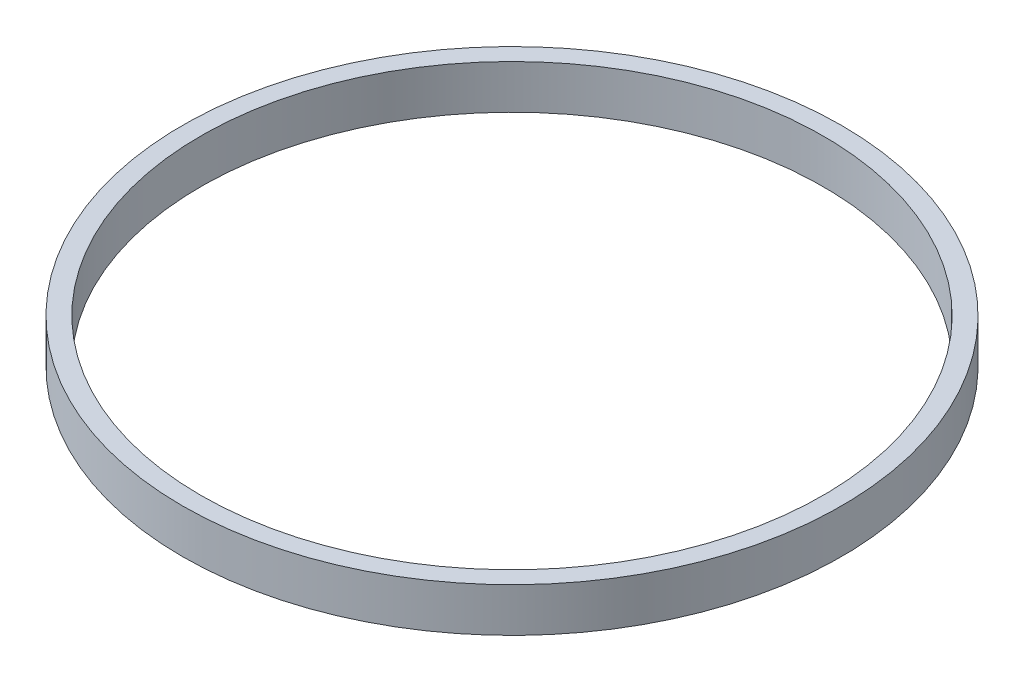
ISO-10303-21;
HEADER;
FILE_DESCRIPTION(('STEP AP214'),'2;1');
FILE_NAME('part.step','',(''),(''),'','','');
FILE_SCHEMA(('AUTOMOTIVE_DESIGN { 1 0 10303 214 1 1 1 1 }'));
ENDSEC;
DATA;
#1=APPLICATION_CONTEXT('core data for automotive mechanical design processes');
#2=APPLICATION_PROTOCOL_DEFINITION('international standard','automotive_design',2000,#1);
#3=PRODUCT_CONTEXT('',#1,'mechanical');
#4=PRODUCT('Part','Part','',(#3));
#5=PRODUCT_RELATED_PRODUCT_CATEGORY('part','',(#4));
#6=PRODUCT_DEFINITION_FORMATION('','',#4);
#7=PRODUCT_DEFINITION_CONTEXT('part definition',#1,'design');
#8=PRODUCT_DEFINITION('design','',#6,#7);
#9=PRODUCT_DEFINITION_SHAPE('','',#8);
#10=(LENGTH_UNIT() NAMED_UNIT(*) SI_UNIT(.MILLI.,.METRE.));
#11=(NAMED_UNIT(*) PLANE_ANGLE_UNIT() SI_UNIT($,.RADIAN.));
#12=(NAMED_UNIT(*) SI_UNIT($,.STERADIAN.) SOLID_ANGLE_UNIT());
#13=UNCERTAINTY_MEASURE_WITH_UNIT(LENGTH_MEASURE(1.E-05),#10,'distance_accuracy_value','');
#14=(GEOMETRIC_REPRESENTATION_CONTEXT(3) GLOBAL_UNCERTAINTY_ASSIGNED_CONTEXT((#13)) GLOBAL_UNIT_ASSIGNED_CONTEXT((#10,
#11,#12)) REPRESENTATION_CONTEXT('',''));
#15=CARTESIAN_POINT('',(0.,0.,0.));
#16=DIRECTION('',(0.,0.,1.));
#17=DIRECTION('',(1.,0.,0.));
#18=AXIS2_PLACEMENT_3D('',#15,#16,#17);
#19=CARTESIAN_POINT('',(0.,6.,0.));
#20=DIRECTION('',(0.,1.,0.));
#21=DIRECTION('',(0.,0.,1.));
#22=AXIS2_PLACEMENT_3D('',#19,#20,#21);
#23=PLANE('',#22);
#24=CARTESIAN_POINT('',(0.,6.,0.));
#25=DIRECTION('',(0.,1.,0.));
#26=DIRECTION('',(0.,0.,1.));
#27=AXIS2_PLACEMENT_3D('',#24,#25,#26);
#28=CIRCLE('',#27,45.);
#29=CARTESIAN_POINT('',(0.,6.,45.));
#30=VERTEX_POINT('',#29);
#31=EDGE_CURVE('E10',#30,#30,#28,.T.);
#32=ORIENTED_EDGE('',*,*,#31,.T.);
#33=EDGE_LOOP('',(#32));
#34=FACE_BOUND('',#33,.T.);
#35=CARTESIAN_POINT('',(0.,6.,0.));
#36=DIRECTION('',(0.,1.,0.));
#37=DIRECTION('',(0.,0.,1.));
#38=AXIS2_PLACEMENT_3D('',#35,#36,#37);
#39=CIRCLE('',#38,42.5);
#40=CARTESIAN_POINT('',(0.,6.,42.5));
#41=VERTEX_POINT('',#40);
#42=EDGE_CURVE('E50',#41,#41,#39,.T.);
#43=ORIENTED_EDGE('',*,*,#42,.F.);
#44=EDGE_LOOP('',(#43));
#45=FACE_BOUND('',#44,.T.);
#46=ADVANCED_FACE('F39',(#34,#45),#23,.T.);
#47=CARTESIAN_POINT('',(0.,0.,0.));
#48=DIRECTION('',(0.,1.,0.));
#49=DIRECTION('',(0.,0.,1.));
#50=AXIS2_PLACEMENT_3D('',#47,#48,#49);
#51=PLANE('',#50);
#52=CARTESIAN_POINT('',(0.,0.,0.));
#53=DIRECTION('',(0.,1.,0.));
#54=DIRECTION('',(0.,0.,1.));
#55=AXIS2_PLACEMENT_3D('',#52,#53,#54);
#56=CIRCLE('',#55,45.);
#57=CARTESIAN_POINT('',(0.,0.,45.));
#58=VERTEX_POINT('',#57);
#59=EDGE_CURVE('E43',#58,#58,#56,.T.);
#60=ORIENTED_EDGE('',*,*,#59,.F.);
#61=EDGE_LOOP('',(#60));
#62=FACE_BOUND('',#61,.T.);
#63=CARTESIAN_POINT('',(0.,0.,0.));
#64=DIRECTION('',(0.,1.,0.));
#65=DIRECTION('',(0.,0.,1.));
#66=AXIS2_PLACEMENT_3D('',#63,#64,#65);
#67=CIRCLE('',#66,42.5);
#68=CARTESIAN_POINT('',(0.,0.,42.5));
#69=VERTEX_POINT('',#68);
#70=EDGE_CURVE('E52',#69,#69,#67,.T.);
#71=ORIENTED_EDGE('',*,*,#70,.T.);
#72=EDGE_LOOP('',(#71));
#73=FACE_BOUND('',#72,.T.);
#74=ADVANCED_FACE('F62',(#62,#73),#51,.F.);
#75=CARTESIAN_POINT('',(0.,6.,0.));
#76=DIRECTION('',(0.,-1.,0.));
#77=DIRECTION('',(0.,0.,-1.));
#78=AXIS2_PLACEMENT_3D('',#75,#76,#77);
#79=CYLINDRICAL_SURFACE('',#78,45.);
#80=ORIENTED_EDGE('',*,*,#31,.F.);
#81=EDGE_LOOP('',(#80));
#82=FACE_BOUND('',#81,.T.);
#83=ORIENTED_EDGE('',*,*,#59,.T.);
#84=EDGE_LOOP('',(#83));
#85=FACE_BOUND('',#84,.T.);
#86=ADVANCED_FACE('F41',(#82,#85),#79,.T.);
#87=CARTESIAN_POINT('',(0.,6.,0.));
#88=DIRECTION('',(0.,-1.,0.));
#89=DIRECTION('',(0.,0.,-1.));
#90=AXIS2_PLACEMENT_3D('',#87,#88,#89);
#91=CYLINDRICAL_SURFACE('',#90,42.5);
#92=ORIENTED_EDGE('',*,*,#42,.T.);
#93=EDGE_LOOP('',(#92));
#94=FACE_BOUND('',#93,.T.);
#95=ORIENTED_EDGE('',*,*,#70,.F.);
#96=EDGE_LOOP('',(#95));
#97=FACE_BOUND('',#96,.T.);
#98=ADVANCED_FACE('F58',(#94,#97),#91,.F.);
#99=CLOSED_SHELL('',(#46,#74,#86,#98));
#100=MANIFOLD_SOLID_BREP('B2',#99);
#101=ADVANCED_BREP_SHAPE_REPRESENTATION('',(#18,#100),#14);
#102=SHAPE_DEFINITION_REPRESENTATION(#9,#101);
ENDSEC;
END-ISO-10303-21;
